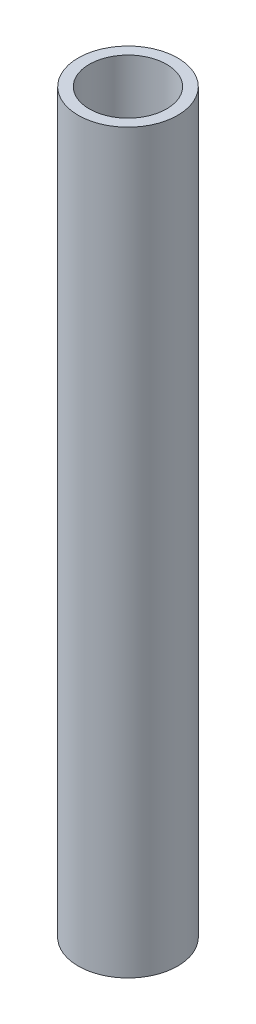
ISO-10303-21;
HEADER;
FILE_DESCRIPTION(('STEP AP214'),'2;1');
FILE_NAME('part.step','',(''),(''),'','','');
FILE_SCHEMA(('AUTOMOTIVE_DESIGN { 1 0 10303 214 1 1 1 1 }'));
ENDSEC;
DATA;
#1=APPLICATION_CONTEXT('core data for automotive mechanical design processes');
#2=APPLICATION_PROTOCOL_DEFINITION('international standard','automotive_design',2000,#1);
#3=PRODUCT_CONTEXT('',#1,'mechanical');
#4=PRODUCT('Part','Part','',(#3));
#5=PRODUCT_RELATED_PRODUCT_CATEGORY('part','',(#4));
#6=PRODUCT_DEFINITION_FORMATION('','',#4);
#7=PRODUCT_DEFINITION_CONTEXT('part definition',#1,'design');
#8=PRODUCT_DEFINITION('design','',#6,#7);
#9=PRODUCT_DEFINITION_SHAPE('','',#8);
#10=(LENGTH_UNIT() NAMED_UNIT(*) SI_UNIT(.MILLI.,.METRE.));
#11=(NAMED_UNIT(*) PLANE_ANGLE_UNIT() SI_UNIT($,.RADIAN.));
#12=(NAMED_UNIT(*) SI_UNIT($,.STERADIAN.) SOLID_ANGLE_UNIT());
#13=UNCERTAINTY_MEASURE_WITH_UNIT(LENGTH_MEASURE(1.E-05),#10,'distance_accuracy_value','');
#14=(GEOMETRIC_REPRESENTATION_CONTEXT(3) GLOBAL_UNCERTAINTY_ASSIGNED_CONTEXT((#13)) GLOBAL_UNIT_ASSIGNED_CONTEXT((#10,
#11,#12)) REPRESENTATION_CONTEXT('',''));
#15=CARTESIAN_POINT('',(0.,0.,0.));
#16=DIRECTION('',(0.,0.,1.));
#17=DIRECTION('',(1.,0.,0.));
#18=AXIS2_PLACEMENT_3D('',#15,#16,#17);
#19=CARTESIAN_POINT('',(0.,200.,0.));
#20=DIRECTION('',(0.,1.,0.));
#21=DIRECTION('',(0.,0.,1.));
#22=AXIS2_PLACEMENT_3D('',#19,#20,#21);
#23=PLANE('',#22);
#24=CARTESIAN_POINT('',(0.,200.,0.));
#25=DIRECTION('',(0.,1.,0.));
#26=DIRECTION('',(0.,0.,1.));
#27=AXIS2_PLACEMENT_3D('',#24,#25,#26);
#28=CIRCLE('',#27,13.5);
#29=CARTESIAN_POINT('',(0.,200.,13.5));
#30=VERTEX_POINT('',#29);
#31=EDGE_CURVE('E10',#30,#30,#28,.T.);
#32=ORIENTED_EDGE('',*,*,#31,.T.);
#33=EDGE_LOOP('',(#32));
#34=FACE_BOUND('',#33,.T.);
#35=CARTESIAN_POINT('',(0.,200.,0.));
#36=DIRECTION('',(0.,1.,0.));
#37=DIRECTION('',(0.,0.,1.));
#38=AXIS2_PLACEMENT_3D('',#35,#36,#37);
#39=CIRCLE('',#38,10.5);
#40=CARTESIAN_POINT('',(0.,200.,10.5));
#41=VERTEX_POINT('',#40);
#42=EDGE_CURVE('E42',#41,#41,#39,.T.);
#43=ORIENTED_EDGE('',*,*,#42,.F.);
#44=EDGE_LOOP('',(#43));
#45=FACE_BOUND('',#44,.T.);
#46=ADVANCED_FACE('F31',(#34,#45),#23,.T.);
#47=CARTESIAN_POINT('',(0.,0.,0.));
#48=DIRECTION('',(0.,1.,0.));
#49=DIRECTION('',(0.,0.,1.));
#50=AXIS2_PLACEMENT_3D('',#47,#48,#49);
#51=PLANE('',#50);
#52=CARTESIAN_POINT('',(0.,0.,0.));
#53=DIRECTION('',(0.,1.,0.));
#54=DIRECTION('',(0.,0.,1.));
#55=AXIS2_PLACEMENT_3D('',#52,#53,#54);
#56=CIRCLE('',#55,13.5);
#57=CARTESIAN_POINT('',(0.,0.,13.5));
#58=VERTEX_POINT('',#57);
#59=EDGE_CURVE('E35',#58,#58,#56,.T.);
#60=ORIENTED_EDGE('',*,*,#59,.F.);
#61=EDGE_LOOP('',(#60));
#62=FACE_BOUND('',#61,.T.);
#63=CARTESIAN_POINT('',(0.,0.,0.));
#64=DIRECTION('',(0.,1.,0.));
#65=DIRECTION('',(0.,0.,1.));
#66=AXIS2_PLACEMENT_3D('',#63,#64,#65);
#67=CIRCLE('',#66,10.5);
#68=CARTESIAN_POINT('',(0.,0.,10.5));
#69=VERTEX_POINT('',#68);
#70=EDGE_CURVE('E44',#69,#69,#67,.T.);
#71=ORIENTED_EDGE('',*,*,#70,.T.);
#72=EDGE_LOOP('',(#71));
#73=FACE_BOUND('',#72,.T.);
#74=ADVANCED_FACE('F54',(#62,#73),#51,.F.);
#75=CARTESIAN_POINT('',(0.,200.,0.));
#76=DIRECTION('',(0.,-1.,0.));
#77=DIRECTION('',(0.,0.,-1.));
#78=AXIS2_PLACEMENT_3D('',#75,#76,#77);
#79=CYLINDRICAL_SURFACE('',#78,13.5);
#80=ORIENTED_EDGE('',*,*,#31,.F.);
#81=EDGE_LOOP('',(#80));
#82=FACE_BOUND('',#81,.T.);
#83=ORIENTED_EDGE('',*,*,#59,.T.);
#84=EDGE_LOOP('',(#83));
#85=FACE_BOUND('',#84,.T.);
#86=ADVANCED_FACE('F33',(#82,#85),#79,.T.);
#87=CARTESIAN_POINT('',(0.,200.,0.));
#88=DIRECTION('',(0.,-1.,0.));
#89=DIRECTION('',(0.,0.,-1.));
#90=AXIS2_PLACEMENT_3D('',#87,#88,#89);
#91=CYLINDRICAL_SURFACE('',#90,10.5);
#92=ORIENTED_EDGE('',*,*,#42,.T.);
#93=EDGE_LOOP('',(#92));
#94=FACE_BOUND('',#93,.T.);
#95=ORIENTED_EDGE('',*,*,#70,.F.);
#96=EDGE_LOOP('',(#95));
#97=FACE_BOUND('',#96,.T.);
#98=ADVANCED_FACE('F50',(#94,#97),#91,.F.);
#99=CLOSED_SHELL('',(#46,#74,#86,#98));
#100=MANIFOLD_SOLID_BREP('B2',#99);
#101=ADVANCED_BREP_SHAPE_REPRESENTATION('',(#18,#100),#14);
#102=SHAPE_DEFINITION_REPRESENTATION(#9,#101);
ENDSEC;
END-ISO-10303-21;
